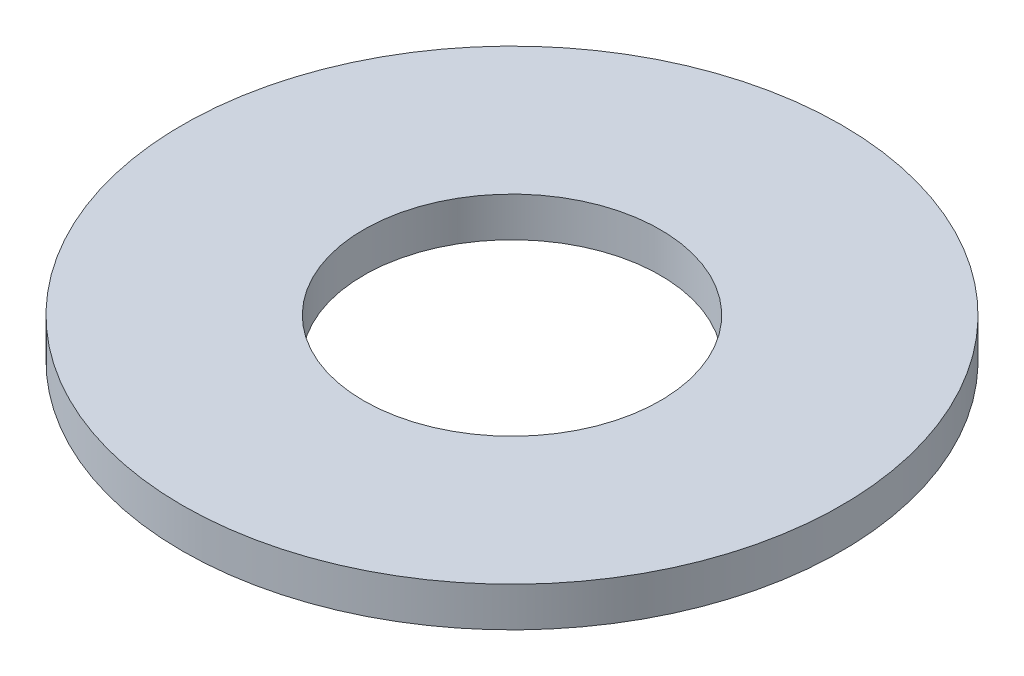
ISO-10303-21;
HEADER;
FILE_DESCRIPTION(('STEP AP214'),'2;1');
FILE_NAME('part.step','',(''),(''),'','','');
FILE_SCHEMA(('AUTOMOTIVE_DESIGN { 1 0 10303 214 1 1 1 1 }'));
ENDSEC;
DATA;
#1=APPLICATION_CONTEXT('core data for automotive mechanical design processes');
#2=APPLICATION_PROTOCOL_DEFINITION('international standard','automotive_design',2000,#1);
#3=PRODUCT_CONTEXT('',#1,'mechanical');
#4=PRODUCT('Part','Part','',(#3));
#5=PRODUCT_RELATED_PRODUCT_CATEGORY('part','',(#4));
#6=PRODUCT_DEFINITION_FORMATION('','',#4);
#7=PRODUCT_DEFINITION_CONTEXT('part definition',#1,'design');
#8=PRODUCT_DEFINITION('design','',#6,#7);
#9=PRODUCT_DEFINITION_SHAPE('','',#8);
#10=(LENGTH_UNIT() NAMED_UNIT(*) SI_UNIT(.MILLI.,.METRE.));
#11=(NAMED_UNIT(*) PLANE_ANGLE_UNIT() SI_UNIT($,.RADIAN.));
#12=(NAMED_UNIT(*) SI_UNIT($,.STERADIAN.) SOLID_ANGLE_UNIT());
#13=UNCERTAINTY_MEASURE_WITH_UNIT(LENGTH_MEASURE(1.E-05),#10,'distance_accuracy_value','');
#14=(GEOMETRIC_REPRESENTATION_CONTEXT(3) GLOBAL_UNCERTAINTY_ASSIGNED_CONTEXT((#13)) GLOBAL_UNIT_ASSIGNED_CONTEXT((#10,
#11,#12)) REPRESENTATION_CONTEXT('',''));
#15=CARTESIAN_POINT('',(0.,0.,0.));
#16=DIRECTION('',(0.,0.,1.));
#17=DIRECTION('',(1.,0.,0.));
#18=AXIS2_PLACEMENT_3D('',#15,#16,#17);
#19=CARTESIAN_POINT('',(0.,6.,0.));
#20=DIRECTION('',(0.,-1.,0.));
#21=DIRECTION('',(0.,0.,-1.));
#22=AXIS2_PLACEMENT_3D('',#19,#20,#21);
#23=CYLINDRICAL_SURFACE('',#22,50.);
#24=CARTESIAN_POINT('',(0.,6.,0.));
#25=DIRECTION('',(0.,1.,0.));
#26=DIRECTION('',(0.,0.,1.));
#27=AXIS2_PLACEMENT_3D('',#24,#25,#26);
#28=CIRCLE('',#27,50.);
#29=CARTESIAN_POINT('',(0.,6.,50.));
#30=VERTEX_POINT('',#29);
#31=EDGE_CURVE('E10',#30,#30,#28,.T.);
#32=ORIENTED_EDGE('',*,*,#31,.F.);
#33=EDGE_LOOP('',(#32));
#34=FACE_BOUND('',#33,.T.);
#35=CARTESIAN_POINT('',(0.,0.,0.));
#36=DIRECTION('',(0.,1.,0.));
#37=DIRECTION('',(0.,0.,1.));
#38=AXIS2_PLACEMENT_3D('',#35,#36,#37);
#39=CIRCLE('',#38,50.);
#40=CARTESIAN_POINT('',(0.,0.,50.));
#41=VERTEX_POINT('',#40);
#42=EDGE_CURVE('E37',#41,#41,#39,.T.);
#43=ORIENTED_EDGE('',*,*,#42,.T.);
#44=EDGE_LOOP('',(#43));
#45=FACE_BOUND('',#44,.T.);
#46=ADVANCED_FACE('F40',(#34,#45),#23,.T.);
#47=CARTESIAN_POINT('',(0.,6.,0.));
#48=DIRECTION('',(0.,1.,0.));
#49=DIRECTION('',(0.,0.,1.));
#50=AXIS2_PLACEMENT_3D('',#47,#48,#49);
#51=PLANE('',#50);
#52=CARTESIAN_POINT('',(0.,6.,0.));
#53=DIRECTION('',(0.,1.,0.));
#54=DIRECTION('',(0.,0.,1.));
#55=AXIS2_PLACEMENT_3D('',#52,#53,#54);
#56=CIRCLE('',#55,22.5);
#57=CARTESIAN_POINT('',(0.,6.,22.5));
#58=VERTEX_POINT('',#57);
#59=EDGE_CURVE('E50',#58,#58,#56,.T.);
#60=ORIENTED_EDGE('',*,*,#59,.F.);
#61=EDGE_LOOP('',(#60));
#62=FACE_BOUND('',#61,.T.);
#63=ORIENTED_EDGE('',*,*,#31,.T.);
#64=EDGE_LOOP('',(#63));
#65=FACE_BOUND('',#64,.T.);
#66=ADVANCED_FACE('F59',(#62,#65),#51,.T.);
#67=CARTESIAN_POINT('',(0.,0.,0.));
#68=DIRECTION('',(0.,1.,0.));
#69=DIRECTION('',(0.,0.,1.));
#70=AXIS2_PLACEMENT_3D('',#67,#68,#69);
#71=PLANE('',#70);
#72=CARTESIAN_POINT('',(0.,0.,0.));
#73=DIRECTION('',(0.,1.,0.));
#74=DIRECTION('',(0.,0.,1.));
#75=AXIS2_PLACEMENT_3D('',#72,#73,#74);
#76=CIRCLE('',#75,22.5);
#77=CARTESIAN_POINT('',(0.,0.,22.5));
#78=VERTEX_POINT('',#77);
#79=EDGE_CURVE('E47',#78,#78,#76,.T.);
#80=ORIENTED_EDGE('',*,*,#79,.T.);
#81=EDGE_LOOP('',(#80));
#82=FACE_BOUND('',#81,.T.);
#83=ORIENTED_EDGE('',*,*,#42,.F.);
#84=EDGE_LOOP('',(#83));
#85=FACE_BOUND('',#84,.T.);
#86=ADVANCED_FACE('F58',(#82,#85),#71,.F.);
#87=CARTESIAN_POINT('',(0.,6.,0.));
#88=DIRECTION('',(0.,-1.,0.));
#89=DIRECTION('',(0.,0.,-1.));
#90=AXIS2_PLACEMENT_3D('',#87,#88,#89);
#91=CYLINDRICAL_SURFACE('',#90,22.5);
#92=ORIENTED_EDGE('',*,*,#59,.T.);
#93=EDGE_LOOP('',(#92));
#94=FACE_BOUND('',#93,.T.);
#95=ORIENTED_EDGE('',*,*,#79,.F.);
#96=EDGE_LOOP('',(#95));
#97=FACE_BOUND('',#96,.T.);
#98=ADVANCED_FACE('F54',(#94,#97),#91,.F.);
#99=CLOSED_SHELL('',(#46,#66,#86,#98));
#100=MANIFOLD_SOLID_BREP('B2',#99);
#101=ADVANCED_BREP_SHAPE_REPRESENTATION('',(#18,#100),#14);
#102=SHAPE_DEFINITION_REPRESENTATION(#9,#101);
ENDSEC;
END-ISO-10303-21;
